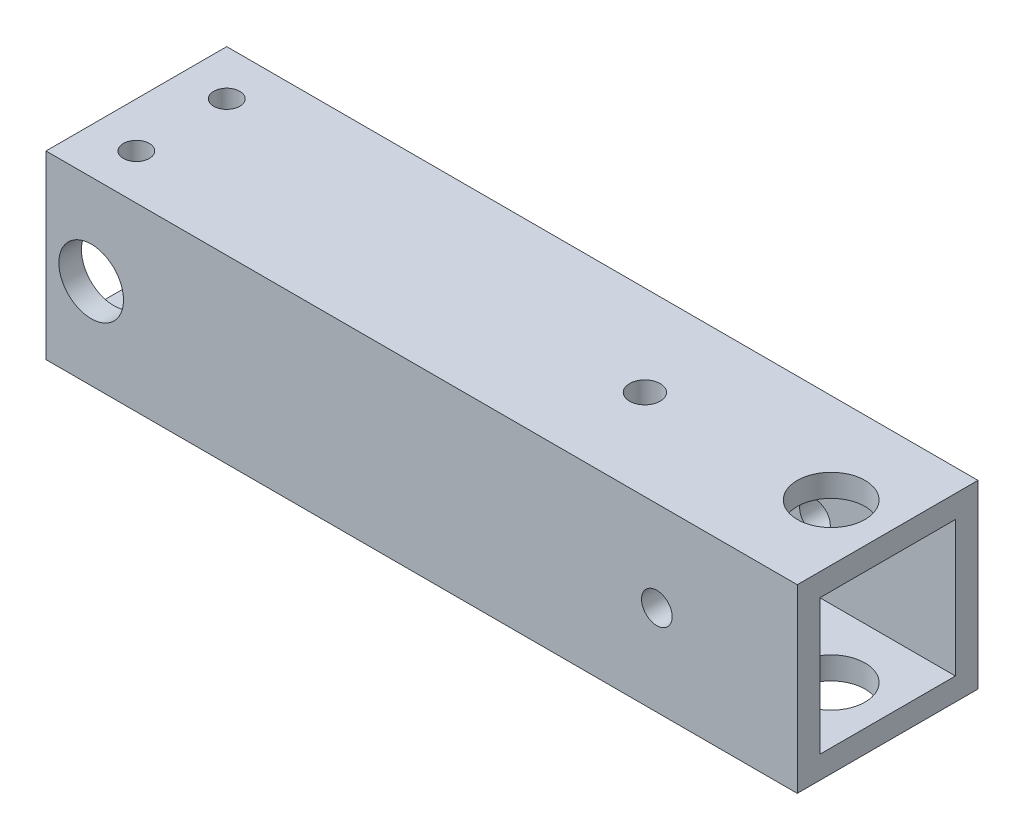
ISO-10303-21;
HEADER;
FILE_DESCRIPTION(('STEP AP214'),'2;1');
FILE_NAME('part.step','',(''),(''),'','','');
FILE_SCHEMA(('AUTOMOTIVE_DESIGN { 1 0 10303 214 1 1 1 1 }'));
ENDSEC;
DATA;
#1=APPLICATION_CONTEXT('core data for automotive mechanical design processes');
#2=APPLICATION_PROTOCOL_DEFINITION('international standard','automotive_design',2000,#1);
#3=PRODUCT_CONTEXT('',#1,'mechanical');
#4=PRODUCT('Part','Part','',(#3));
#5=PRODUCT_RELATED_PRODUCT_CATEGORY('part','',(#4));
#6=PRODUCT_DEFINITION_FORMATION('','',#4);
#7=PRODUCT_DEFINITION_CONTEXT('part definition',#1,'design');
#8=PRODUCT_DEFINITION('design','',#6,#7);
#9=PRODUCT_DEFINITION_SHAPE('','',#8);
#10=(LENGTH_UNIT() NAMED_UNIT(*) SI_UNIT(.MILLI.,.METRE.));
#11=(NAMED_UNIT(*) PLANE_ANGLE_UNIT() SI_UNIT($,.RADIAN.));
#12=(NAMED_UNIT(*) SI_UNIT($,.STERADIAN.) SOLID_ANGLE_UNIT());
#13=UNCERTAINTY_MEASURE_WITH_UNIT(LENGTH_MEASURE(1.E-05),#10,'distance_accuracy_value','');
#14=(GEOMETRIC_REPRESENTATION_CONTEXT(3) GLOBAL_UNCERTAINTY_ASSIGNED_CONTEXT((#13)) GLOBAL_UNIT_ASSIGNED_CONTEXT((#10,
#11,#12)) REPRESENTATION_CONTEXT('',''));
#15=CARTESIAN_POINT('',(0.,0.,0.));
#16=DIRECTION('',(0.,0.,1.));
#17=DIRECTION('',(1.,0.,0.));
#18=AXIS2_PLACEMENT_3D('',#15,#16,#17);
#19=CARTESIAN_POINT('',(-42.926,170.18,-68.2625));
#20=DIRECTION('',(0.,1.,0.));
#21=DIRECTION('',(0.,0.,1.));
#22=AXIS2_PLACEMENT_3D('',#19,#20,#21);
#23=CYLINDRICAL_SURFACE('',#22,1.8288);
#24=CARTESIAN_POINT('',(-42.926,192.405,-68.2625));
#25=DIRECTION('',(0.,1.,0.));
#26=DIRECTION('',(0.,0.,1.));
#27=AXIS2_PLACEMENT_3D('',#24,#25,#26);
#28=CIRCLE('',#27,1.8288);
#29=CARTESIAN_POINT('',(-42.926,192.405,-66.4337));
#30=VERTEX_POINT('',#29);
#31=EDGE_CURVE('E155',#30,#30,#28,.T.);
#32=ORIENTED_EDGE('',*,*,#31,.F.);
#33=EDGE_LOOP('',(#32));
#34=FACE_BOUND('',#33,.T.);
#35=CARTESIAN_POINT('',(-42.926,195.58,-68.2625));
#36=DIRECTION('',(0.,1.,0.));
#37=DIRECTION('',(0.,0.,1.));
#38=AXIS2_PLACEMENT_3D('',#35,#36,#37);
#39=CIRCLE('',#38,1.8288);
#40=CARTESIAN_POINT('',(-42.926,195.58,-66.4337));
#41=VERTEX_POINT('',#40);
#42=EDGE_CURVE('E173',#41,#41,#39,.F.);
#43=ORIENTED_EDGE('',*,*,#42,.F.);
#44=EDGE_LOOP('',(#43));
#45=FACE_BOUND('',#44,.T.);
#46=ADVANCED_FACE('F40',(#34,#45),#23,.F.);
#47=CARTESIAN_POINT('',(48.37744504714,170.18,-74.6125));
#48=DIRECTION('',(0.,1.,0.));
#49=DIRECTION('',(0.,0.,1.));
#50=AXIS2_PLACEMENT_3D('',#47,#48,#49);
#51=CYLINDRICAL_SURFACE('',#50,4.7625);
#52=CARTESIAN_POINT('',(48.37744504714,192.405,-74.6125));
#53=DIRECTION('',(0.,1.,0.));
#54=DIRECTION('',(0.,0.,1.));
#55=AXIS2_PLACEMENT_3D('',#52,#53,#54);
#56=CIRCLE('',#55,4.7625);
#57=CARTESIAN_POINT('',(48.37744504714,192.405,-69.85));
#58=VERTEX_POINT('',#57);
#59=EDGE_CURVE('E152',#58,#58,#56,.F.);
#60=ORIENTED_EDGE('',*,*,#59,.T.);
#61=EDGE_LOOP('',(#60));
#62=FACE_BOUND('',#61,.T.);
#63=CARTESIAN_POINT('',(48.37744504714,195.58,-74.6125));
#64=DIRECTION('',(0.,1.,0.));
#65=DIRECTION('',(0.,0.,1.));
#66=AXIS2_PLACEMENT_3D('',#63,#64,#65);
#67=CIRCLE('',#66,4.7625);
#68=CARTESIAN_POINT('',(48.37744504714,195.58,-69.85));
#69=VERTEX_POINT('',#68);
#70=EDGE_CURVE('E170',#69,#69,#67,.T.);
#71=ORIENTED_EDGE('',*,*,#70,.T.);
#72=EDGE_LOOP('',(#71));
#73=FACE_BOUND('',#72,.T.);
#74=ADVANCED_FACE('F282',(#62,#73),#51,.F.);
#75=CARTESIAN_POINT('',(-42.926,170.18,-80.9624999999999));
#76=DIRECTION('',(0.,1.,0.));
#77=DIRECTION('',(0.,0.,1.));
#78=AXIS2_PLACEMENT_3D('',#75,#76,#77);
#79=CYLINDRICAL_SURFACE('',#78,1.8288);
#80=CARTESIAN_POINT('',(-42.926,192.405,-80.9624999999999));
#81=DIRECTION('',(0.,1.,0.));
#82=DIRECTION('',(0.,0.,1.));
#83=AXIS2_PLACEMENT_3D('',#80,#81,#82);
#84=CIRCLE('',#83,1.8288);
#85=CARTESIAN_POINT('',(-42.926,192.405,-79.1336999999999));
#86=VERTEX_POINT('',#85);
#87=EDGE_CURVE('E151',#86,#86,#84,.F.);
#88=ORIENTED_EDGE('',*,*,#87,.T.);
#89=EDGE_LOOP('',(#88));
#90=FACE_BOUND('',#89,.T.);
#91=CARTESIAN_POINT('',(-42.926,195.58,-80.9624999999999));
#92=DIRECTION('',(0.,1.,0.));
#93=DIRECTION('',(0.,0.,1.));
#94=AXIS2_PLACEMENT_3D('',#91,#92,#93);
#95=CIRCLE('',#94,1.8288);
#96=CARTESIAN_POINT('',(-42.926,195.58,-79.1336999999999));
#97=VERTEX_POINT('',#96);
#98=EDGE_CURVE('E176',#97,#97,#95,.T.);
#99=ORIENTED_EDGE('',*,*,#98,.T.);
#100=EDGE_LOOP('',(#99));
#101=FACE_BOUND('',#100,.T.);
#102=ADVANCED_FACE('F242',(#90,#101),#79,.F.);
#103=CARTESIAN_POINT('',(-49.276,170.18,0.));
#104=DIRECTION('',(1.,0.,0.));
#105=DIRECTION('',(0.,0.,-1.));
#106=AXIS2_PLACEMENT_3D('',#103,#104,#105);
#107=PLANE('',#106);
#108=DIRECTION('',(0.,-1.,0.));
#109=VECTOR('',#108,1.);
#110=CARTESIAN_POINT('',(-49.276,173.355,-84.1374999999999));
#111=LINE('',#110,#109);
#112=CARTESIAN_POINT('',(-49.276,192.405,-84.1374999999999));
#113=VERTEX_POINT('',#112);
#114=CARTESIAN_POINT('',(-49.276,173.355,-84.1374999999999));
#115=VERTEX_POINT('',#114);
#116=EDGE_CURVE('E131',#113,#115,#111,.T.);
#117=ORIENTED_EDGE('',*,*,#116,.F.);
#118=DIRECTION('',(0.,0.,-1.));
#119=VECTOR('',#118,1.);
#120=CARTESIAN_POINT('',(-49.276,192.405,-84.1374999999999));
#121=LINE('',#120,#119);
#122=CARTESIAN_POINT('',(-49.276,192.405,-65.0875));
#123=VERTEX_POINT('',#122);
#124=EDGE_CURVE('E124',#123,#113,#121,.T.);
#125=ORIENTED_EDGE('',*,*,#124,.F.);
#126=DIRECTION('',(0.,1.,0.));
#127=VECTOR('',#126,1.);
#128=CARTESIAN_POINT('',(-49.276,173.355,-65.0875));
#129=LINE('',#128,#127);
#130=CARTESIAN_POINT('',(-49.276,173.355,-65.0875));
#131=VERTEX_POINT('',#130);
#132=EDGE_CURVE('E135',#131,#123,#129,.T.);
#133=ORIENTED_EDGE('',*,*,#132,.F.);
#134=DIRECTION('',(0.,0.,1.));
#135=VECTOR('',#134,1.);
#136=CARTESIAN_POINT('',(-49.276,173.355,-84.1374999999999));
#137=LINE('',#136,#135);
#138=EDGE_CURVE('E57',#115,#131,#137,.T.);
#139=ORIENTED_EDGE('',*,*,#138,.F.);
#140=EDGE_LOOP('',(#117,#125,#133,#139));
#141=FACE_BOUND('',#140,.T.);
#142=DIRECTION('',(0.,1.,0.));
#143=VECTOR('',#142,1.);
#144=CARTESIAN_POINT('',(-49.276,170.18,-61.9125));
#145=LINE('',#144,#143);
#146=CARTESIAN_POINT('',(-49.276,170.18,-61.9125));
#147=VERTEX_POINT('',#146);
#148=CARTESIAN_POINT('',(-49.276,195.58,-61.9125));
#149=VERTEX_POINT('',#148);
#150=EDGE_CURVE('E197',#147,#149,#145,.T.);
#151=ORIENTED_EDGE('',*,*,#150,.T.);
#152=DIRECTION('',(0.,0.,-1.));
#153=VECTOR('',#152,1.);
#154=CARTESIAN_POINT('',(-49.276,195.58,0.));
#155=LINE('',#154,#153);
#156=CARTESIAN_POINT('',(-49.276,195.58,-87.3124999999999));
#157=VERTEX_POINT('',#156);
#158=EDGE_CURVE('E158',#149,#157,#155,.T.);
#159=ORIENTED_EDGE('',*,*,#158,.T.);
#160=DIRECTION('',(0.,1.,0.));
#161=VECTOR('',#160,1.);
#162=CARTESIAN_POINT('',(-49.276,170.18,-87.3124999999999));
#163=LINE('',#162,#161);
#164=CARTESIAN_POINT('',(-49.276,170.18,-87.3124999999999));
#165=VERTEX_POINT('',#164);
#166=EDGE_CURVE('E11',#165,#157,#163,.T.);
#167=ORIENTED_EDGE('',*,*,#166,.F.);
#168=DIRECTION('',(0.,0.,-1.));
#169=VECTOR('',#168,1.);
#170=CARTESIAN_POINT('',(-49.276,170.18,0.));
#171=LINE('',#170,#169);
#172=EDGE_CURVE('E179',#147,#165,#171,.T.);
#173=ORIENTED_EDGE('',*,*,#172,.F.);
#174=EDGE_LOOP('',(#151,#159,#167,#173));
#175=FACE_BOUND('',#174,.T.);
#176=ADVANCED_FACE('F42',(#141,#175),#107,.F.);
#177=CARTESIAN_POINT('',(0.,170.18,-87.3124999999999));
#178=DIRECTION('',(0.,0.,-1.));
#179=DIRECTION('',(-1.,0.,0.));
#180=AXIS2_PLACEMENT_3D('',#177,#178,#179);
#181=PLANE('',#180);
#182=CARTESIAN_POINT('',(36.5760000000001,182.88,-87.3125));
#183=DIRECTION('',(0.,0.,-1.));
#184=DIRECTION('',(-1.,0.,0.));
#185=AXIS2_PLACEMENT_3D('',#182,#183,#184);
#186=CIRCLE('',#185,2.15265000000001);
#187=CARTESIAN_POINT('',(34.4233500000001,182.88,-87.3125));
#188=VERTEX_POINT('',#187);
#189=EDGE_CURVE('E214',#188,#188,#186,.F.);
#190=ORIENTED_EDGE('',*,*,#189,.T.);
#191=EDGE_LOOP('',(#190));
#192=FACE_BOUND('',#191,.T.);
#193=CARTESIAN_POINT('',(-42.926,182.88,-87.3124999999999));
#194=DIRECTION('',(0.,0.,-1.));
#195=DIRECTION('',(-1.,0.,0.));
#196=AXIS2_PLACEMENT_3D('',#193,#194,#195);
#197=CIRCLE('',#196,4.54400959726098);
#198=CARTESIAN_POINT('',(-47.470009597261,182.88,-87.3124999999999));
#199=VERTEX_POINT('',#198);
#200=EDGE_CURVE('E218',#199,#199,#197,.T.);
#201=ORIENTED_EDGE('',*,*,#200,.F.);
#202=EDGE_LOOP('',(#201));
#203=FACE_BOUND('',#202,.T.);
#204=ORIENTED_EDGE('',*,*,#166,.T.);
#205=DIRECTION('',(-1.,0.,0.));
#206=VECTOR('',#205,1.);
#207=CARTESIAN_POINT('',(0.,195.58,-87.3124999999999));
#208=LINE('',#207,#206);
#209=CARTESIAN_POINT('',(56.31494504714,195.58,-87.3125));
#210=VERTEX_POINT('',#209);
#211=EDGE_CURVE('E167',#210,#157,#208,.T.);
#212=ORIENTED_EDGE('',*,*,#211,.F.);
#213=DIRECTION('',(0.,1.,0.));
#214=VECTOR('',#213,1.);
#215=CARTESIAN_POINT('',(56.31494504714,170.18,-87.3125));
#216=LINE('',#215,#214);
#217=CARTESIAN_POINT('',(56.31494504714,170.18,-87.3125));
#218=VERTEX_POINT('',#217);
#219=EDGE_CURVE('E49',#218,#210,#216,.T.);
#220=ORIENTED_EDGE('',*,*,#219,.F.);
#221=DIRECTION('',(-1.,0.,0.));
#222=VECTOR('',#221,1.);
#223=CARTESIAN_POINT('',(0.,170.18,-87.3124999999999));
#224=LINE('',#223,#222);
#225=EDGE_CURVE('E186',#218,#165,#224,.T.);
#226=ORIENTED_EDGE('',*,*,#225,.T.);
#227=EDGE_LOOP('',(#204,#212,#220,#226));
#228=FACE_BOUND('',#227,.T.);
#229=ADVANCED_FACE('F241',(#192,#203,#228),#181,.T.);
#230=CARTESIAN_POINT('',(56.31494504714,170.18,0.));
#231=DIRECTION('',(1.,0.,0.));
#232=DIRECTION('',(0.,0.,-1.));
#233=AXIS2_PLACEMENT_3D('',#230,#231,#232);
#234=PLANE('',#233);
#235=DIRECTION('',(0.,0.,-1.));
#236=VECTOR('',#235,1.);
#237=CARTESIAN_POINT('',(56.31494504714,192.405,-84.1374999999999));
#238=LINE('',#237,#236);
#239=CARTESIAN_POINT('',(56.31494504714,192.405,-65.0875));
#240=VERTEX_POINT('',#239);
#241=CARTESIAN_POINT('',(56.31494504714,192.405,-84.1374999999999));
#242=VERTEX_POINT('',#241);
#243=EDGE_CURVE('E121',#240,#242,#238,.T.);
#244=ORIENTED_EDGE('',*,*,#243,.T.);
#245=DIRECTION('',(0.,-1.,0.));
#246=VECTOR('',#245,1.);
#247=CARTESIAN_POINT('',(56.31494504714,173.355,-84.1374999999999));
#248=LINE('',#247,#246);
#249=CARTESIAN_POINT('',(56.31494504714,173.355,-84.1374999999999));
#250=VERTEX_POINT('',#249);
#251=EDGE_CURVE('E107',#242,#250,#248,.T.);
#252=ORIENTED_EDGE('',*,*,#251,.T.);
#253=DIRECTION('',(0.,0.,1.));
#254=VECTOR('',#253,1.);
#255=CARTESIAN_POINT('',(56.31494504714,173.355,-84.1374999999999));
#256=LINE('',#255,#254);
#257=CARTESIAN_POINT('',(56.31494504714,173.355,-65.0875));
#258=VERTEX_POINT('',#257);
#259=EDGE_CURVE('E139',#250,#258,#256,.T.);
#260=ORIENTED_EDGE('',*,*,#259,.T.);
#261=DIRECTION('',(0.,1.,0.));
#262=VECTOR('',#261,1.);
#263=CARTESIAN_POINT('',(56.31494504714,173.355,-65.0875));
#264=LINE('',#263,#262);
#265=EDGE_CURVE('E129',#258,#240,#264,.T.);
#266=ORIENTED_EDGE('',*,*,#265,.T.);
#267=EDGE_LOOP('',(#244,#252,#260,#266));
#268=FACE_BOUND('',#267,.T.);
#269=ORIENTED_EDGE('',*,*,#219,.T.);
#270=DIRECTION('',(0.,0.,-1.));
#271=VECTOR('',#270,1.);
#272=CARTESIAN_POINT('',(56.31494504714,195.58,0.));
#273=LINE('',#272,#271);
#274=CARTESIAN_POINT('',(56.31494504714,195.58,-61.9125));
#275=VERTEX_POINT('',#274);
#276=EDGE_CURVE('E164',#275,#210,#273,.T.);
#277=ORIENTED_EDGE('',*,*,#276,.F.);
#278=DIRECTION('',(0.,1.,0.));
#279=VECTOR('',#278,1.);
#280=CARTESIAN_POINT('',(56.31494504714,170.18,-61.9125));
#281=LINE('',#280,#279);
#282=CARTESIAN_POINT('',(56.31494504714,170.18,-61.9125));
#283=VERTEX_POINT('',#282);
#284=EDGE_CURVE('E200',#283,#275,#281,.T.);
#285=ORIENTED_EDGE('',*,*,#284,.F.);
#286=DIRECTION('',(0.,0.,-1.));
#287=VECTOR('',#286,1.);
#288=CARTESIAN_POINT('',(56.31494504714,170.18,0.));
#289=LINE('',#288,#287);
#290=EDGE_CURVE('E183',#283,#218,#289,.T.);
#291=ORIENTED_EDGE('',*,*,#290,.T.);
#292=EDGE_LOOP('',(#269,#277,#285,#291));
#293=FACE_BOUND('',#292,.T.);
#294=ADVANCED_FACE('F127',(#268,#293),#234,.T.);
#295=CARTESIAN_POINT('',(-42.926,173.355,-68.2625));
#296=DIRECTION('',(0.,-1.,0.));
#297=DIRECTION('',(0.,0.,-1.));
#298=AXIS2_PLACEMENT_3D('',#295,#296,#297);
#299=CIRCLE('',#298,1.8288);
#300=CARTESIAN_POINT('',(-42.926,173.355,-70.0913));
#301=VERTEX_POINT('',#300);
#302=EDGE_CURVE('E148',#301,#301,#299,.T.);
#303=ORIENTED_EDGE('',*,*,#302,.F.);
#304=EDGE_LOOP('',(#303));
#305=FACE_BOUND('',#304,.T.);
#306=CARTESIAN_POINT('',(-42.926,170.18,-68.2625));
#307=DIRECTION('',(0.,1.,0.));
#308=DIRECTION('',(0.,0.,1.));
#309=AXIS2_PLACEMENT_3D('',#306,#307,#308);
#310=CIRCLE('',#309,1.8288);
#311=CARTESIAN_POINT('',(-42.926,170.18,-66.4337));
#312=VERTEX_POINT('',#311);
#313=EDGE_CURVE('E192',#312,#312,#310,.F.);
#314=ORIENTED_EDGE('',*,*,#313,.T.);
#315=EDGE_LOOP('',(#314));
#316=FACE_BOUND('',#315,.T.);
#317=ADVANCED_FACE('F286',(#305,#316),#23,.F.);
#318=CARTESIAN_POINT('',(48.37744504714,173.355,-74.6125));
#319=DIRECTION('',(0.,-1.,0.));
#320=DIRECTION('',(0.,0.,-1.));
#321=AXIS2_PLACEMENT_3D('',#318,#319,#320);
#322=CIRCLE('',#321,4.7625);
#323=CARTESIAN_POINT('',(48.37744504714,173.355,-79.375));
#324=VERTEX_POINT('',#323);
#325=EDGE_CURVE('E145',#324,#324,#322,.F.);
#326=ORIENTED_EDGE('',*,*,#325,.T.);
#327=EDGE_LOOP('',(#326));
#328=FACE_BOUND('',#327,.T.);
#329=CARTESIAN_POINT('',(48.37744504714,170.18,-74.6125));
#330=DIRECTION('',(0.,1.,0.));
#331=DIRECTION('',(0.,0.,1.));
#332=AXIS2_PLACEMENT_3D('',#329,#330,#331);
#333=CIRCLE('',#332,4.7625);
#334=CARTESIAN_POINT('',(48.37744504714,170.18,-69.85));
#335=VERTEX_POINT('',#334);
#336=EDGE_CURVE('E189',#335,#335,#333,.T.);
#337=ORIENTED_EDGE('',*,*,#336,.F.);
#338=EDGE_LOOP('',(#337));
#339=FACE_BOUND('',#338,.T.);
#340=ADVANCED_FACE('F278',(#328,#339),#51,.F.);
#341=CARTESIAN_POINT('',(0.,170.18,-61.9125));
#342=DIRECTION('',(0.,0.,-1.));
#343=DIRECTION('',(-1.,0.,0.));
#344=AXIS2_PLACEMENT_3D('',#341,#342,#343);
#345=PLANE('',#344);
#346=CARTESIAN_POINT('',(36.5760000000001,182.88,-61.9125));
#347=DIRECTION('',(0.,0.,1.));
#348=DIRECTION('',(1.,0.,0.));
#349=AXIS2_PLACEMENT_3D('',#346,#347,#348);
#350=CIRCLE('',#349,2.15265000000001);
#351=CARTESIAN_POINT('',(38.7286500000001,182.88,-61.9125));
#352=VERTEX_POINT('',#351);
#353=EDGE_CURVE('E221',#352,#352,#350,.T.);
#354=ORIENTED_EDGE('',*,*,#353,.F.);
#355=EDGE_LOOP('',(#354));
#356=FACE_BOUND('',#355,.T.);
#357=CARTESIAN_POINT('',(-42.926,182.88,-61.9125));
#358=DIRECTION('',(0.,0.,-1.));
#359=DIRECTION('',(-1.,0.,0.));
#360=AXIS2_PLACEMENT_3D('',#357,#358,#359);
#361=CIRCLE('',#360,4.54400959726098);
#362=CARTESIAN_POINT('',(-47.470009597261,182.88,-61.9125));
#363=VERTEX_POINT('',#362);
#364=EDGE_CURVE('E210',#363,#363,#361,.F.);
#365=ORIENTED_EDGE('',*,*,#364,.F.);
#366=EDGE_LOOP('',(#365));
#367=FACE_BOUND('',#366,.T.);
#368=ORIENTED_EDGE('',*,*,#284,.T.);
#369=DIRECTION('',(-1.,0.,0.));
#370=VECTOR('',#369,1.);
#371=CARTESIAN_POINT('',(0.,195.58,-61.9125));
#372=LINE('',#371,#370);
#373=EDGE_CURVE('E161',#275,#149,#372,.T.);
#374=ORIENTED_EDGE('',*,*,#373,.T.);
#375=ORIENTED_EDGE('',*,*,#150,.F.);
#376=DIRECTION('',(-1.,0.,0.));
#377=VECTOR('',#376,1.);
#378=CARTESIAN_POINT('',(0.,170.18,-61.9125));
#379=LINE('',#378,#377);
#380=EDGE_CURVE('E181',#283,#147,#379,.T.);
#381=ORIENTED_EDGE('',*,*,#380,.F.);
#382=EDGE_LOOP('',(#368,#374,#375,#381));
#383=FACE_BOUND('',#382,.T.);
#384=ADVANCED_FACE('F254',(#356,#367,#383),#345,.F.);
#385=CARTESIAN_POINT('',(-42.926,173.355,-80.9624999999999));
#386=DIRECTION('',(0.,-1.,0.));
#387=DIRECTION('',(0.,0.,-1.));
#388=AXIS2_PLACEMENT_3D('',#385,#386,#387);
#389=CIRCLE('',#388,1.8288);
#390=CARTESIAN_POINT('',(-42.926,173.355,-82.7912999999999));
#391=VERTEX_POINT('',#390);
#392=EDGE_CURVE('E144',#391,#391,#389,.F.);
#393=ORIENTED_EDGE('',*,*,#392,.T.);
#394=EDGE_LOOP('',(#393));
#395=FACE_BOUND('',#394,.T.);
#396=CARTESIAN_POINT('',(-42.926,170.18,-80.9624999999999));
#397=DIRECTION('',(0.,1.,0.));
#398=DIRECTION('',(0.,0.,1.));
#399=AXIS2_PLACEMENT_3D('',#396,#397,#398);
#400=CIRCLE('',#399,1.8288);
#401=CARTESIAN_POINT('',(-42.926,170.18,-79.1336999999999));
#402=VERTEX_POINT('',#401);
#403=EDGE_CURVE('E195',#402,#402,#400,.T.);
#404=ORIENTED_EDGE('',*,*,#403,.F.);
#405=EDGE_LOOP('',(#404));
#406=FACE_BOUND('',#405,.T.);
#407=ADVANCED_FACE('F263',(#395,#406),#79,.F.);
#408=CARTESIAN_POINT('',(0.,170.18,0.));
#409=DIRECTION('',(0.,1.,0.));
#410=DIRECTION('',(0.,0.,1.));
#411=AXIS2_PLACEMENT_3D('',#408,#409,#410);
#412=PLANE('',#411);
#413=CARTESIAN_POINT('',(22.1957243244678,170.18,-74.6125));
#414=DIRECTION('',(0.,-1.,0.));
#415=DIRECTION('',(0.,0.,-1.));
#416=AXIS2_PLACEMENT_3D('',#413,#414,#415);
#417=CIRCLE('',#416,2.15265);
#418=CARTESIAN_POINT('',(22.1957243244678,170.18,-76.76515));
#419=VERTEX_POINT('',#418);
#420=EDGE_CURVE('E334',#419,#419,#417,.T.);
#421=ORIENTED_EDGE('',*,*,#420,.F.);
#422=EDGE_LOOP('',(#421));
#423=FACE_BOUND('',#422,.T.);
#424=ORIENTED_EDGE('',*,*,#172,.T.);
#425=ORIENTED_EDGE('',*,*,#225,.F.);
#426=ORIENTED_EDGE('',*,*,#290,.F.);
#427=ORIENTED_EDGE('',*,*,#380,.T.);
#428=EDGE_LOOP('',(#424,#425,#426,#427));
#429=FACE_BOUND('',#428,.T.);
#430=ORIENTED_EDGE('',*,*,#336,.T.);
#431=EDGE_LOOP('',(#430));
#432=FACE_BOUND('',#431,.T.);
#433=ORIENTED_EDGE('',*,*,#313,.F.);
#434=EDGE_LOOP('',(#433));
#435=FACE_BOUND('',#434,.T.);
#436=ORIENTED_EDGE('',*,*,#403,.T.);
#437=EDGE_LOOP('',(#436));
#438=FACE_BOUND('',#437,.T.);
#439=ADVANCED_FACE('F260',(#423,#429,#432,#435,#438),#412,.F.);
#440=CARTESIAN_POINT('',(0.,195.58,0.));
#441=DIRECTION('',(0.,1.,0.));
#442=DIRECTION('',(0.,0.,1.));
#443=AXIS2_PLACEMENT_3D('',#440,#441,#442);
#444=PLANE('',#443);
#445=CARTESIAN_POINT('',(22.1957243244678,195.58,-74.6125));
#446=DIRECTION('',(0.,1.,0.));
#447=DIRECTION('',(0.,0.,1.));
#448=AXIS2_PLACEMENT_3D('',#445,#446,#447);
#449=CIRCLE('',#448,2.15265);
#450=CARTESIAN_POINT('',(22.1957243244678,195.58,-72.45985));
#451=VERTEX_POINT('',#450);
#452=EDGE_CURVE('E332',#451,#451,#449,.F.);
#453=ORIENTED_EDGE('',*,*,#452,.T.);
#454=EDGE_LOOP('',(#453));
#455=FACE_BOUND('',#454,.T.);
#456=ORIENTED_EDGE('',*,*,#158,.F.);
#457=ORIENTED_EDGE('',*,*,#373,.F.);
#458=ORIENTED_EDGE('',*,*,#276,.T.);
#459=ORIENTED_EDGE('',*,*,#211,.T.);
#460=EDGE_LOOP('',(#456,#457,#458,#459));
#461=FACE_BOUND('',#460,.T.);
#462=ORIENTED_EDGE('',*,*,#70,.F.);
#463=EDGE_LOOP('',(#462));
#464=FACE_BOUND('',#463,.T.);
#465=ORIENTED_EDGE('',*,*,#42,.T.);
#466=EDGE_LOOP('',(#465));
#467=FACE_BOUND('',#466,.T.);
#468=ORIENTED_EDGE('',*,*,#98,.F.);
#469=EDGE_LOOP('',(#468));
#470=FACE_BOUND('',#469,.T.);
#471=ADVANCED_FACE('F251',(#455,#461,#464,#467,#470),#444,.T.);
#472=CARTESIAN_POINT('',(83.2557134103474,192.405,-84.1374999999999));
#473=DIRECTION('',(0.,1.,0.));
#474=DIRECTION('',(0.,0.,1.));
#475=AXIS2_PLACEMENT_3D('',#472,#473,#474);
#476=PLANE('',#475);
#477=CARTESIAN_POINT('',(22.1957243244678,192.405,-74.6125));
#478=DIRECTION('',(0.,1.,0.));
#479=DIRECTION('',(0.,0.,1.));
#480=AXIS2_PLACEMENT_3D('',#477,#478,#479);
#481=CIRCLE('',#480,2.15265);
#482=CARTESIAN_POINT('',(22.1957243244678,192.405,-72.45985));
#483=VERTEX_POINT('',#482);
#484=EDGE_CURVE('E226',#483,#483,#481,.T.);
#485=ORIENTED_EDGE('',*,*,#484,.T.);
#486=EDGE_LOOP('',(#485));
#487=FACE_BOUND('',#486,.T.);
#488=ORIENTED_EDGE('',*,*,#31,.T.);
#489=EDGE_LOOP('',(#488));
#490=FACE_BOUND('',#489,.T.);
#491=ORIENTED_EDGE('',*,*,#87,.F.);
#492=EDGE_LOOP('',(#491));
#493=FACE_BOUND('',#492,.T.);
#494=DIRECTION('',(-1.,0.,0.));
#495=VECTOR('',#494,1.);
#496=CARTESIAN_POINT('',(83.2557134103474,192.405,-65.0875));
#497=LINE('',#496,#495);
#498=EDGE_CURVE('E65',#240,#123,#497,.T.);
#499=ORIENTED_EDGE('',*,*,#498,.T.);
#500=ORIENTED_EDGE('',*,*,#124,.T.);
#501=DIRECTION('',(-1.,0.,0.));
#502=VECTOR('',#501,1.);
#503=CARTESIAN_POINT('',(83.2557134103474,192.405,-84.1374999999999));
#504=LINE('',#503,#502);
#505=EDGE_CURVE('E111',#242,#113,#504,.T.);
#506=ORIENTED_EDGE('',*,*,#505,.F.);
#507=ORIENTED_EDGE('',*,*,#243,.F.);
#508=EDGE_LOOP('',(#499,#500,#506,#507));
#509=FACE_BOUND('',#508,.T.);
#510=ORIENTED_EDGE('',*,*,#59,.F.);
#511=EDGE_LOOP('',(#510));
#512=FACE_BOUND('',#511,.T.);
#513=ADVANCED_FACE('F119',(#487,#490,#493,#509,#512),#476,.F.);
#514=CARTESIAN_POINT('',(83.2557134103474,173.355,-84.1374999999999));
#515=DIRECTION('',(0.,-1.,0.));
#516=DIRECTION('',(0.,0.,-1.));
#517=AXIS2_PLACEMENT_3D('',#514,#515,#516);
#518=PLANE('',#517);
#519=CARTESIAN_POINT('',(22.1957243244678,173.355,-74.6125));
#520=DIRECTION('',(0.,-1.,0.));
#521=DIRECTION('',(0.,0.,-1.));
#522=AXIS2_PLACEMENT_3D('',#519,#520,#521);
#523=CIRCLE('',#522,2.15265);
#524=CARTESIAN_POINT('',(22.1957243244678,173.355,-76.76515));
#525=VERTEX_POINT('',#524);
#526=EDGE_CURVE('E44',#525,#525,#523,.T.);
#527=ORIENTED_EDGE('',*,*,#526,.T.);
#528=EDGE_LOOP('',(#527));
#529=FACE_BOUND('',#528,.T.);
#530=ORIENTED_EDGE('',*,*,#302,.T.);
#531=EDGE_LOOP('',(#530));
#532=FACE_BOUND('',#531,.T.);
#533=ORIENTED_EDGE('',*,*,#392,.F.);
#534=EDGE_LOOP('',(#533));
#535=FACE_BOUND('',#534,.T.);
#536=DIRECTION('',(-1.,0.,0.));
#537=VECTOR('',#536,1.);
#538=CARTESIAN_POINT('',(83.2557134103474,173.355,-84.1374999999999));
#539=LINE('',#538,#537);
#540=EDGE_CURVE('E113',#250,#115,#539,.T.);
#541=ORIENTED_EDGE('',*,*,#540,.T.);
#542=ORIENTED_EDGE('',*,*,#138,.T.);
#543=DIRECTION('',(-1.,0.,0.));
#544=VECTOR('',#543,1.);
#545=CARTESIAN_POINT('',(83.2557134103474,173.355,-65.0875));
#546=LINE('',#545,#544);
#547=EDGE_CURVE('E138',#258,#131,#546,.T.);
#548=ORIENTED_EDGE('',*,*,#547,.F.);
#549=ORIENTED_EDGE('',*,*,#259,.F.);
#550=EDGE_LOOP('',(#541,#542,#548,#549));
#551=FACE_BOUND('',#550,.T.);
#552=ORIENTED_EDGE('',*,*,#325,.F.);
#553=EDGE_LOOP('',(#552));
#554=FACE_BOUND('',#553,.T.);
#555=ADVANCED_FACE('F305',(#529,#532,#535,#551,#554),#518,.F.);
#556=CARTESIAN_POINT('',(83.2557134103474,173.355,-84.1374999999999));
#557=DIRECTION('',(0.,0.,-1.));
#558=DIRECTION('',(-1.,0.,0.));
#559=AXIS2_PLACEMENT_3D('',#556,#557,#558);
#560=PLANE('',#559);
#561=CARTESIAN_POINT('',(36.5760000000001,182.88,-84.1374999999999));
#562=DIRECTION('',(0.,0.,-1.));
#563=DIRECTION('',(-1.,0.,0.));
#564=AXIS2_PLACEMENT_3D('',#561,#562,#563);
#565=CIRCLE('',#564,2.15265000000001);
#566=CARTESIAN_POINT('',(34.4233500000001,182.88,-84.1374999999999));
#567=VERTEX_POINT('',#566);
#568=EDGE_CURVE('E213',#567,#567,#565,.T.);
#569=ORIENTED_EDGE('',*,*,#568,.T.);
#570=EDGE_LOOP('',(#569));
#571=FACE_BOUND('',#570,.T.);
#572=CARTESIAN_POINT('',(-42.926,182.88,-84.1374999999999));
#573=DIRECTION('',(0.,0.,-1.));
#574=DIRECTION('',(-1.,0.,0.));
#575=AXIS2_PLACEMENT_3D('',#572,#573,#574);
#576=CIRCLE('',#575,4.54400959726098);
#577=CARTESIAN_POINT('',(-47.470009597261,182.88,-84.1374999999999));
#578=VERTEX_POINT('',#577);
#579=EDGE_CURVE('E209',#578,#578,#576,.T.);
#580=ORIENTED_EDGE('',*,*,#579,.T.);
#581=EDGE_LOOP('',(#580));
#582=FACE_BOUND('',#581,.T.);
#583=ORIENTED_EDGE('',*,*,#505,.T.);
#584=ORIENTED_EDGE('',*,*,#116,.T.);
#585=ORIENTED_EDGE('',*,*,#540,.F.);
#586=ORIENTED_EDGE('',*,*,#251,.F.);
#587=EDGE_LOOP('',(#583,#584,#585,#586));
#588=FACE_BOUND('',#587,.T.);
#589=ADVANCED_FACE('F109',(#571,#582,#588),#560,.F.);
#590=CARTESIAN_POINT('',(83.2557134103474,173.355,-65.0875));
#591=DIRECTION('',(0.,0.,1.));
#592=DIRECTION('',(1.,0.,0.));
#593=AXIS2_PLACEMENT_3D('',#590,#591,#592);
#594=PLANE('',#593);
#595=CARTESIAN_POINT('',(36.5760000000001,182.88,-65.0875));
#596=DIRECTION('',(0.,0.,1.));
#597=DIRECTION('',(1.,0.,0.));
#598=AXIS2_PLACEMENT_3D('',#595,#596,#597);
#599=CIRCLE('',#598,2.15265000000001);
#600=CARTESIAN_POINT('',(38.7286500000001,182.88,-65.0875));
#601=VERTEX_POINT('',#600);
#602=EDGE_CURVE('E211',#601,#601,#599,.T.);
#603=ORIENTED_EDGE('',*,*,#602,.T.);
#604=EDGE_LOOP('',(#603));
#605=FACE_BOUND('',#604,.T.);
#606=CARTESIAN_POINT('',(-42.926,182.88,-65.0875));
#607=DIRECTION('',(0.,0.,1.));
#608=DIRECTION('',(1.,0.,0.));
#609=AXIS2_PLACEMENT_3D('',#606,#607,#608);
#610=CIRCLE('',#609,4.54400959726098);
#611=CARTESIAN_POINT('',(-38.3819904027391,182.88,-65.0875));
#612=VERTEX_POINT('',#611);
#613=EDGE_CURVE('E207',#612,#612,#610,.T.);
#614=ORIENTED_EDGE('',*,*,#613,.T.);
#615=EDGE_LOOP('',(#614));
#616=FACE_BOUND('',#615,.T.);
#617=ORIENTED_EDGE('',*,*,#547,.T.);
#618=ORIENTED_EDGE('',*,*,#132,.T.);
#619=ORIENTED_EDGE('',*,*,#498,.F.);
#620=ORIENTED_EDGE('',*,*,#265,.F.);
#621=EDGE_LOOP('',(#617,#618,#619,#620));
#622=FACE_BOUND('',#621,.T.);
#623=ADVANCED_FACE('F237',(#605,#616,#622),#594,.F.);
#624=CARTESIAN_POINT('',(-42.926,182.88,-49.0601));
#625=DIRECTION('',(0.,0.,-1.));
#626=DIRECTION('',(-1.,0.,0.));
#627=AXIS2_PLACEMENT_3D('',#624,#625,#626);
#628=CYLINDRICAL_SURFACE('',#627,4.54400959726098);
#629=ORIENTED_EDGE('',*,*,#364,.T.);
#630=EDGE_LOOP('',(#629));
#631=FACE_BOUND('',#630,.T.);
#632=ORIENTED_EDGE('',*,*,#613,.F.);
#633=EDGE_LOOP('',(#632));
#634=FACE_BOUND('',#633,.T.);
#635=ADVANCED_FACE('F357',(#631,#634),#628,.F.);
#636=ORIENTED_EDGE('',*,*,#200,.T.);
#637=EDGE_LOOP('',(#636));
#638=FACE_BOUND('',#637,.T.);
#639=ORIENTED_EDGE('',*,*,#579,.F.);
#640=EDGE_LOOP('',(#639));
#641=FACE_BOUND('',#640,.T.);
#642=ADVANCED_FACE('F355',(#638,#641),#628,.F.);
#643=CARTESIAN_POINT('',(36.5760000000001,182.88,-93.4011136500849));
#644=DIRECTION('',(0.,0.,1.));
#645=DIRECTION('',(1.,0.,0.));
#646=AXIS2_PLACEMENT_3D('',#643,#644,#645);
#647=CYLINDRICAL_SURFACE('',#646,2.15265000000001);
#648=ORIENTED_EDGE('',*,*,#353,.T.);
#649=EDGE_LOOP('',(#648));
#650=FACE_BOUND('',#649,.T.);
#651=ORIENTED_EDGE('',*,*,#602,.F.);
#652=EDGE_LOOP('',(#651));
#653=FACE_BOUND('',#652,.T.);
#654=ADVANCED_FACE('F353',(#650,#653),#647,.F.);
#655=ORIENTED_EDGE('',*,*,#189,.F.);
#656=EDGE_LOOP('',(#655));
#657=FACE_BOUND('',#656,.T.);
#658=ORIENTED_EDGE('',*,*,#568,.F.);
#659=EDGE_LOOP('',(#658));
#660=FACE_BOUND('',#659,.T.);
#661=ADVANCED_FACE('F349',(#657,#660),#647,.F.);
#662=CARTESIAN_POINT('',(22.1957243244678,201.668613650085,-74.6125));
#663=DIRECTION('',(0.,-1.,0.));
#664=DIRECTION('',(0.,0.,-1.));
#665=AXIS2_PLACEMENT_3D('',#662,#663,#664);
#666=CYLINDRICAL_SURFACE('',#665,2.15265);
#667=ORIENTED_EDGE('',*,*,#420,.T.);
#668=EDGE_LOOP('',(#667));
#669=FACE_BOUND('',#668,.T.);
#670=ORIENTED_EDGE('',*,*,#526,.F.);
#671=EDGE_LOOP('',(#670));
#672=FACE_BOUND('',#671,.T.);
#673=ADVANCED_FACE('F344',(#669,#672),#666,.F.);
#674=ORIENTED_EDGE('',*,*,#452,.F.);
#675=EDGE_LOOP('',(#674));
#676=FACE_BOUND('',#675,.T.);
#677=ORIENTED_EDGE('',*,*,#484,.F.);
#678=EDGE_LOOP('',(#677));
#679=FACE_BOUND('',#678,.T.);
#680=ADVANCED_FACE('F342',(#676,#679),#666,.F.);
#681=CLOSED_SHELL('',(#46,#74,#102,#176,#229,#294,#317,#340,#384,#407,#439,#471,#513,#555,#589,
#623,#635,#642,#654,#661,#673,#680));
#682=MANIFOLD_SOLID_BREP('B2',#681);
#683=ADVANCED_BREP_SHAPE_REPRESENTATION('',(#18,#682),#14);
#684=SHAPE_DEFINITION_REPRESENTATION(#9,#683);
ENDSEC;
END-ISO-10303-21;
